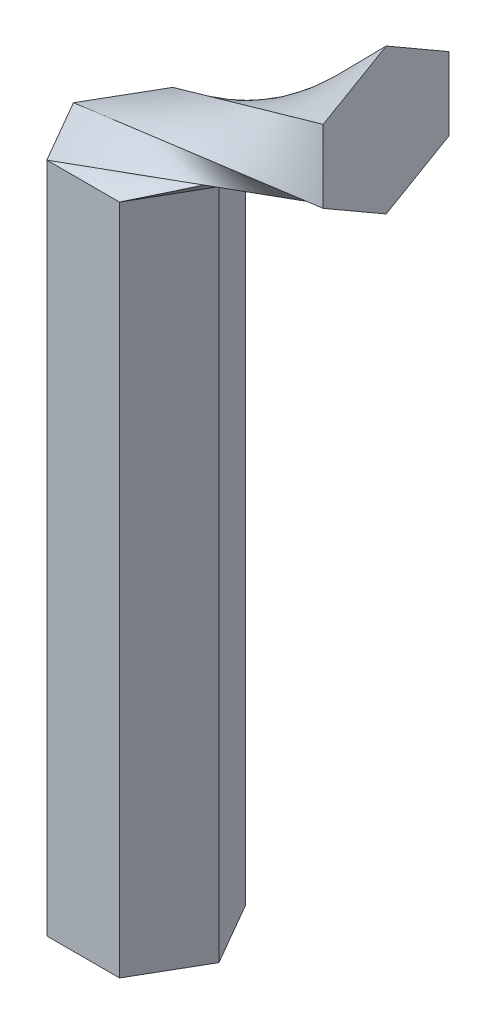
ISO-10303-21;
HEADER;
FILE_DESCRIPTION(('STEP AP214'),'2;1');
FILE_NAME('part.step','',(''),(''),'','','');
FILE_SCHEMA(('AUTOMOTIVE_DESIGN { 1 0 10303 214 1 1 1 1 }'));
ENDSEC;
DATA;
#1=APPLICATION_CONTEXT('core data for automotive mechanical design processes');
#2=APPLICATION_PROTOCOL_DEFINITION('international standard','automotive_design',2000,#1);
#3=PRODUCT_CONTEXT('',#1,'mechanical');
#4=PRODUCT('Part','Part','',(#3));
#5=PRODUCT_RELATED_PRODUCT_CATEGORY('part','',(#4));
#6=PRODUCT_DEFINITION_FORMATION('','',#4);
#7=PRODUCT_DEFINITION_CONTEXT('part definition',#1,'design');
#8=PRODUCT_DEFINITION('design','',#6,#7);
#9=PRODUCT_DEFINITION_SHAPE('','',#8);
#10=(LENGTH_UNIT() NAMED_UNIT(*) SI_UNIT(.MILLI.,.METRE.));
#11=(NAMED_UNIT(*) PLANE_ANGLE_UNIT() SI_UNIT($,.RADIAN.));
#12=(NAMED_UNIT(*) SI_UNIT($,.STERADIAN.) SOLID_ANGLE_UNIT());
#13=UNCERTAINTY_MEASURE_WITH_UNIT(LENGTH_MEASURE(1.E-05),#10,'distance_accuracy_value','');
#14=(GEOMETRIC_REPRESENTATION_CONTEXT(3) GLOBAL_UNCERTAINTY_ASSIGNED_CONTEXT((#13)) GLOBAL_UNIT_ASSIGNED_CONTEXT((#10,
#11,#12)) REPRESENTATION_CONTEXT('',''));
#15=CARTESIAN_POINT('',(0.,0.,0.));
#16=DIRECTION('',(0.,0.,1.));
#17=DIRECTION('',(1.,0.,0.));
#18=AXIS2_PLACEMENT_3D('',#15,#16,#17);
#19=CARTESIAN_POINT('',(3.84948291982184,35.56,6.66749999999999));
#20=DIRECTION('',(-0.866025403784439,0.,-0.5));
#21=DIRECTION('',(-0.5,0.,0.866025403784439));
#22=AXIS2_PLACEMENT_3D('',#19,#20,#21);
#23=PLANE('',#22);
#24=DIRECTION('',(0.5,0.,-0.866025403784439));
#25=VECTOR('',#24,1.);
#26=CARTESIAN_POINT('',(3.84948291982184,-35.56,6.66749999999999));
#27=LINE('',#26,#25);
#28=CARTESIAN_POINT('',(3.84948291982184,-35.56,6.66749999999999));
#29=VERTEX_POINT('',#28);
#30=CARTESIAN_POINT('',(7.69896583964366,-35.56,0.));
#31=VERTEX_POINT('',#30);
#32=EDGE_CURVE('E146',#29,#31,#27,.T.);
#33=ORIENTED_EDGE('',*,*,#32,.T.);
#34=DIRECTION('',(0.,-1.,0.));
#35=VECTOR('',#34,1.);
#36=CARTESIAN_POINT('',(7.69896583964366,35.56,0.));
#37=LINE('',#36,#35);
#38=CARTESIAN_POINT('',(7.69896583964366,35.56,0.));
#39=VERTEX_POINT('',#38);
#40=EDGE_CURVE('E12',#39,#31,#37,.T.);
#41=ORIENTED_EDGE('',*,*,#40,.F.);
#42=DIRECTION('',(-0.5,0.,0.866025403784439));
#43=VECTOR('',#42,1.);
#44=CARTESIAN_POINT('',(3.84948291982184,35.56,6.66749999999999));
#45=LINE('',#44,#43);
#46=CARTESIAN_POINT('',(3.84948291982183,35.56,6.6675));
#47=VERTEX_POINT('',#46);
#48=EDGE_CURVE('E60',#47,#39,#45,.F.);
#49=ORIENTED_EDGE('',*,*,#48,.F.);
#50=DIRECTION('',(0.,-1.,0.));
#51=VECTOR('',#50,1.);
#52=CARTESIAN_POINT('',(3.84948291982184,35.56,6.66749999999999));
#53=LINE('',#52,#51);
#54=EDGE_CURVE('E390',#47,#29,#53,.T.);
#55=ORIENTED_EDGE('',*,*,#54,.T.);
#56=EDGE_LOOP('',(#33,#41,#49,#55));
#57=FACE_BOUND('',#56,.T.);
#58=ADVANCED_FACE('F57',(#57),#23,.F.);
#59=CARTESIAN_POINT('',(7.69896583964366,35.56,0.));
#60=DIRECTION('',(-0.866025403784438,0.,0.5));
#61=DIRECTION('',(0.500000000000001,0.,0.866025403784438));
#62=AXIS2_PLACEMENT_3D('',#59,#60,#61);
#63=PLANE('',#62);
#64=DIRECTION('',(-0.500000000000001,0.,-0.866025403784438));
#65=VECTOR('',#64,1.);
#66=CARTESIAN_POINT('',(7.69896583964366,-35.56,0.));
#67=LINE('',#66,#65);
#68=CARTESIAN_POINT('',(3.84948291982181,-35.56,-6.6675));
#69=VERTEX_POINT('',#68);
#70=EDGE_CURVE('E415',#31,#69,#67,.T.);
#71=ORIENTED_EDGE('',*,*,#70,.T.);
#72=DIRECTION('',(0.,-1.,0.));
#73=VECTOR('',#72,1.);
#74=CARTESIAN_POINT('',(3.84948291982181,35.56,-6.6675));
#75=LINE('',#74,#73);
#76=CARTESIAN_POINT('',(3.84948291982181,35.56,-6.6675));
#77=VERTEX_POINT('',#76);
#78=EDGE_CURVE('E67',#77,#69,#75,.T.);
#79=ORIENTED_EDGE('',*,*,#78,.F.);
#80=DIRECTION('',(0.500000000000001,0.,0.866025403784438));
#81=VECTOR('',#80,1.);
#82=CARTESIAN_POINT('',(7.69896583964366,35.56,0.));
#83=LINE('',#82,#81);
#84=EDGE_CURVE('E134',#39,#77,#83,.F.);
#85=ORIENTED_EDGE('',*,*,#84,.F.);
#86=ORIENTED_EDGE('',*,*,#40,.T.);
#87=EDGE_LOOP('',(#71,#79,#85,#86));
#88=FACE_BOUND('',#87,.T.);
#89=ADVANCED_FACE('F135',(#88),#63,.F.);
#90=CARTESIAN_POINT('',(3.84948291982181,35.56,-6.6675));
#91=DIRECTION('',(0.,0.,1.));
#92=DIRECTION('',(1.,0.,0.));
#93=AXIS2_PLACEMENT_3D('',#90,#91,#92);
#94=PLANE('',#93);
#95=DIRECTION('',(-1.,0.,0.));
#96=VECTOR('',#95,1.);
#97=CARTESIAN_POINT('',(3.84948291982181,-35.56,-6.6675));
#98=LINE('',#97,#96);
#99=CARTESIAN_POINT('',(-3.84948291982183,-35.56,-6.6675));
#100=VERTEX_POINT('',#99);
#101=EDGE_CURVE('E412',#69,#100,#98,.T.);
#102=ORIENTED_EDGE('',*,*,#101,.T.);
#103=DIRECTION('',(0.,-1.,0.));
#104=VECTOR('',#103,1.);
#105=CARTESIAN_POINT('',(-3.84948291982183,35.56,-6.6675));
#106=LINE('',#105,#104);
#107=CARTESIAN_POINT('',(-3.84948291982183,35.56,-6.6675));
#108=VERTEX_POINT('',#107);
#109=EDGE_CURVE('E394',#108,#100,#106,.T.);
#110=ORIENTED_EDGE('',*,*,#109,.F.);
#111=DIRECTION('',(1.,0.,0.));
#112=VECTOR('',#111,1.);
#113=CARTESIAN_POINT('',(3.84948291982181,35.56,-6.6675));
#114=LINE('',#113,#112);
#115=EDGE_CURVE('E144',#77,#108,#114,.F.);
#116=ORIENTED_EDGE('',*,*,#115,.F.);
#117=ORIENTED_EDGE('',*,*,#78,.T.);
#118=EDGE_LOOP('',(#102,#110,#116,#117));
#119=FACE_BOUND('',#118,.T.);
#120=ADVANCED_FACE('F432',(#119),#94,.F.);
#121=CARTESIAN_POINT('',(-3.84948291982183,35.56,-6.6675));
#122=DIRECTION('',(0.866025403784438,0.,0.5));
#123=DIRECTION('',(0.5,0.,-0.866025403784438));
#124=AXIS2_PLACEMENT_3D('',#121,#122,#123);
#125=PLANE('',#124);
#126=DIRECTION('',(-0.5,0.,0.866025403784438));
#127=VECTOR('',#126,1.);
#128=CARTESIAN_POINT('',(-3.84948291982183,-35.56,-6.6675));
#129=LINE('',#128,#127);
#130=CARTESIAN_POINT('',(-7.69896583964366,-35.56,0.));
#131=VERTEX_POINT('',#130);
#132=EDGE_CURVE('E409',#100,#131,#129,.T.);
#133=ORIENTED_EDGE('',*,*,#132,.T.);
#134=DIRECTION('',(0.,-1.,0.));
#135=VECTOR('',#134,1.);
#136=CARTESIAN_POINT('',(-7.69896583964366,35.56,0.));
#137=LINE('',#136,#135);
#138=CARTESIAN_POINT('',(-7.69896583964366,35.56,0.));
#139=VERTEX_POINT('',#138);
#140=EDGE_CURVE('E398',#139,#131,#137,.T.);
#141=ORIENTED_EDGE('',*,*,#140,.F.);
#142=DIRECTION('',(0.5,0.,-0.866025403784438));
#143=VECTOR('',#142,1.);
#144=CARTESIAN_POINT('',(-3.84948291982183,35.56,-6.6675));
#145=LINE('',#144,#143);
#146=EDGE_CURVE('E314',#108,#139,#145,.F.);
#147=ORIENTED_EDGE('',*,*,#146,.F.);
#148=ORIENTED_EDGE('',*,*,#109,.T.);
#149=EDGE_LOOP('',(#133,#141,#147,#148));
#150=FACE_BOUND('',#149,.T.);
#151=ADVANCED_FACE('F433',(#150),#125,.F.);
#152=CARTESIAN_POINT('',(-7.69896583964366,35.56,0.));
#153=DIRECTION('',(0.866025403784438,0.,-0.500000000000001));
#154=DIRECTION('',(-0.500000000000001,0.,-0.866025403784438));
#155=AXIS2_PLACEMENT_3D('',#152,#153,#154);
#156=PLANE('',#155);
#157=DIRECTION('',(0.500000000000001,0.,0.866025403784438));
#158=VECTOR('',#157,1.);
#159=CARTESIAN_POINT('',(-7.69896583964366,-35.56,0.));
#160=LINE('',#159,#158);
#161=CARTESIAN_POINT('',(-3.84948291982183,-35.56,6.6675));
#162=VERTEX_POINT('',#161);
#163=EDGE_CURVE('E126',#131,#162,#160,.T.);
#164=ORIENTED_EDGE('',*,*,#163,.T.);
#165=DIRECTION('',(0.,-1.,0.));
#166=VECTOR('',#165,1.);
#167=CARTESIAN_POINT('',(-3.84948291982183,35.56,6.6675));
#168=LINE('',#167,#166);
#169=CARTESIAN_POINT('',(-3.84948291982184,35.56,6.6675));
#170=VERTEX_POINT('',#169);
#171=EDGE_CURVE('E76',#170,#162,#168,.T.);
#172=ORIENTED_EDGE('',*,*,#171,.F.);
#173=DIRECTION('',(-0.500000000000001,0.,-0.866025403784438));
#174=VECTOR('',#173,1.);
#175=CARTESIAN_POINT('',(-7.69896583964366,35.56,0.));
#176=LINE('',#175,#174);
#177=EDGE_CURVE('E382',#139,#170,#176,.F.);
#178=ORIENTED_EDGE('',*,*,#177,.F.);
#179=ORIENTED_EDGE('',*,*,#140,.T.);
#180=EDGE_LOOP('',(#164,#172,#178,#179));
#181=FACE_BOUND('',#180,.T.);
#182=ADVANCED_FACE('F427',(#181),#156,.F.);
#183=CARTESIAN_POINT('',(-3.84948291982183,35.56,6.6675));
#184=DIRECTION('',(0.,0.,-1.));
#185=DIRECTION('',(-1.,0.,0.));
#186=AXIS2_PLACEMENT_3D('',#183,#184,#185);
#187=PLANE('',#186);
#188=DIRECTION('',(1.,0.,0.));
#189=VECTOR('',#188,1.);
#190=CARTESIAN_POINT('',(-3.84948291982183,-35.56,6.6675));
#191=LINE('',#190,#189);
#192=EDGE_CURVE('E130',#162,#29,#191,.T.);
#193=ORIENTED_EDGE('',*,*,#192,.T.);
#194=ORIENTED_EDGE('',*,*,#54,.F.);
#195=DIRECTION('',(-1.,0.,0.));
#196=VECTOR('',#195,1.);
#197=CARTESIAN_POINT('',(-3.84948291982183,35.56,6.6675));
#198=LINE('',#197,#196);
#199=EDGE_CURVE('E387',#170,#47,#198,.F.);
#200=ORIENTED_EDGE('',*,*,#199,.F.);
#201=ORIENTED_EDGE('',*,*,#171,.T.);
#202=EDGE_LOOP('',(#193,#194,#200,#201));
#203=FACE_BOUND('',#202,.T.);
#204=ADVANCED_FACE('F440',(#203),#187,.F.);
#205=CARTESIAN_POINT('',(0.,-35.56,0.));
#206=DIRECTION('',(0.,1.,0.));
#207=DIRECTION('',(0.,0.,1.));
#208=AXIS2_PLACEMENT_3D('',#205,#206,#207);
#209=PLANE('',#208);
#210=ORIENTED_EDGE('',*,*,#32,.F.);
#211=ORIENTED_EDGE('',*,*,#192,.F.);
#212=ORIENTED_EDGE('',*,*,#163,.F.);
#213=ORIENTED_EDGE('',*,*,#132,.F.);
#214=ORIENTED_EDGE('',*,*,#101,.F.);
#215=ORIENTED_EDGE('',*,*,#70,.F.);
#216=EDGE_LOOP('',(#210,#211,#212,#213,#214,#215));
#217=FACE_BOUND('',#216,.T.);
#218=ADVANCED_FACE('F201',(#217),#209,.F.);
#219=CARTESIAN_POINT('',(25.4,0.,0.));
#220=DIRECTION('',(1.,0.,0.));
#221=DIRECTION('',(0.,0.,-1.));
#222=AXIS2_PLACEMENT_3D('',#219,#220,#221);
#223=PLANE('',#222);
#224=DIRECTION('',(0.,0.5,-0.866025403784439));
#225=VECTOR('',#224,1.);
#226=CARTESIAN_POINT('',(25.4,41.91,0.));
#227=LINE('',#226,#225);
#228=CARTESIAN_POINT('',(25.4,41.91,0.));
#229=VERTEX_POINT('',#228);
#230=CARTESIAN_POINT('',(25.4,45.7594829198218,-6.6675));
#231=VERTEX_POINT('',#230);
#232=EDGE_CURVE('E290',#229,#231,#227,.T.);
#233=ORIENTED_EDGE('',*,*,#232,.T.);
#234=DIRECTION('',(0.,1.,0.));
#235=VECTOR('',#234,1.);
#236=CARTESIAN_POINT('',(25.4,45.7594829198218,-6.6675));
#237=LINE('',#236,#235);
#238=CARTESIAN_POINT('',(25.4,53.4584487594655,-6.6675));
#239=VERTEX_POINT('',#238);
#240=EDGE_CURVE('E108',#231,#239,#237,.T.);
#241=ORIENTED_EDGE('',*,*,#240,.T.);
#242=DIRECTION('',(0.,0.5,0.866025403784439));
#243=VECTOR('',#242,1.);
#244=CARTESIAN_POINT('',(25.4,53.4584487594655,-6.6675));
#245=LINE('',#244,#243);
#246=CARTESIAN_POINT('',(25.4,57.3079316792873,0.));
#247=VERTEX_POINT('',#246);
#248=EDGE_CURVE('E153',#239,#247,#245,.T.);
#249=ORIENTED_EDGE('',*,*,#248,.T.);
#250=DIRECTION('',(0.,-0.499999999999999,0.866025403784439));
#251=VECTOR('',#250,1.);
#252=CARTESIAN_POINT('',(25.4,57.3079316792873,0.));
#253=LINE('',#252,#251);
#254=CARTESIAN_POINT('',(25.4,53.4584487594655,6.66749999999999));
#255=VERTEX_POINT('',#254);
#256=EDGE_CURVE('E295',#247,#255,#253,.T.);
#257=ORIENTED_EDGE('',*,*,#256,.T.);
#258=DIRECTION('',(0.,-1.,0.));
#259=VECTOR('',#258,1.);
#260=CARTESIAN_POINT('',(25.4,53.4584487594655,6.66749999999999));
#261=LINE('',#260,#259);
#262=CARTESIAN_POINT('',(25.4,45.7594829198218,6.66749999999999));
#263=VERTEX_POINT('',#262);
#264=EDGE_CURVE('E230',#255,#263,#261,.T.);
#265=ORIENTED_EDGE('',*,*,#264,.T.);
#266=DIRECTION('',(0.,-0.5,-0.866025403784439));
#267=VECTOR('',#266,1.);
#268=CARTESIAN_POINT('',(25.4,45.7594829198218,6.66749999999999));
#269=LINE('',#268,#267);
#270=EDGE_CURVE('E224',#263,#229,#269,.T.);
#271=ORIENTED_EDGE('',*,*,#270,.T.);
#272=EDGE_LOOP('',(#233,#241,#249,#257,#265,#271));
#273=FACE_BOUND('',#272,.T.);
#274=ADVANCED_FACE('F244',(#273),#223,.T.);
#275=CARTESIAN_POINT('',(25.4,45.7594829198218,6.66749999999999));
#276=CARTESIAN_POINT('',(-7.69896583964366,35.56,0.));
#277=CARTESIAN_POINT('',(25.4,47.0426438930958,6.66749999999999));
#278=CARTESIAN_POINT('',(-7.05738535300669,35.56,-1.11125));
#279=CARTESIAN_POINT('',(25.4,48.3258048663697,6.66749999999999));
#280=CARTESIAN_POINT('',(-6.41580486636972,35.56,-2.2225));
#281=CARTESIAN_POINT('',(25.4,50.8921268129176,6.66749999999999));
#282=CARTESIAN_POINT('',(-5.13264389309577,35.56,-4.445));
#283=CARTESIAN_POINT('',(25.4,52.1752877861916,6.66749999999999));
#284=CARTESIAN_POINT('',(-4.4910634064588,35.56,-5.55625));
#285=CARTESIAN_POINT('',(25.4,53.4584487594655,6.66749999999999));
#286=CARTESIAN_POINT('',(-3.84948291982183,35.56,-6.6675));
#287=B_SPLINE_SURFACE_WITH_KNOTS('',3,1,((#275,#276),(#277,#278),(#279,#280),(#281,#282),(#283,
#284),(#285,#286)),.UNSPECIFIED.,.F.,.F.,.F.,(4,2,4),(2,2),(0.,0.5,1.),(0.,1.),.UNSPECIFIED.);
#288=DIRECTION('',(-0.794978793454759,-0.486466281763534,-0.36243520064196));
#289=VECTOR('',#288,1.);
#290=CARTESIAN_POINT('',(10.7752585400891,44.5092243797327,0.));
#291=LINE('',#290,#289);
#292=EDGE_CURVE('E162',#255,#108,#291,.T.);
#293=DIRECTION('',(0.938425067978282,0.289176722280341,0.18903760229424));
#294=VECTOR('',#293,1.);
#295=CARTESIAN_POINT('',(8.85051708017817,40.6597414599109,3.33375));
#296=LINE('',#295,#294);
#297=EDGE_CURVE('E229',#139,#263,#296,.T.);
#298=ORIENTED_EDGE('',*,*,#264,.F.);
#299=ORIENTED_EDGE('',*,*,#292,.T.);
#300=ORIENTED_EDGE('',*,*,#146,.T.);
#301=ORIENTED_EDGE('',*,*,#297,.T.);
#302=EDGE_LOOP('',(#298,#299,#300,#301));
#303=FACE_BOUND('',#302,.T.);
#304=ADVANCED_FACE('F253',(#303),#287,.T.);
#305=CARTESIAN_POINT('',(25.4,53.4584487594655,6.66749999999999));
#306=CARTESIAN_POINT('',(-3.84948291982183,35.56,-6.6675));
#307=CARTESIAN_POINT('',(25.4,54.1000292461024,5.55625000000004));
#308=CARTESIAN_POINT('',(-2.56632194654789,35.56,-6.6675));
#309=CARTESIAN_POINT('',(25.4,54.7416097327394,4.44500000000006));
#310=CARTESIAN_POINT('',(-1.28316097327395,35.56,-6.6675));
#311=CARTESIAN_POINT('',(25.4,56.0247707060133,2.22250000000007));
#312=CARTESIAN_POINT('',(1.28316097327393,35.56,-6.6675));
#313=CARTESIAN_POINT('',(25.4,56.6663511926503,1.11125000000005));
#314=CARTESIAN_POINT('',(2.56632194654787,35.56,-6.6675));
#315=CARTESIAN_POINT('',(25.4,57.3079316792873,0.));
#316=CARTESIAN_POINT('',(3.84948291982181,35.56,-6.6675));
#317=B_SPLINE_SURFACE_WITH_KNOTS('',3,1,((#305,#306),(#307,#308),(#309,#310),(#311,#312),(#313,
#314),(#315,#316)),.UNSPECIFIED.,.F.,.F.,.F.,(4,2,4),(2,2),(0.,0.5,1.),(0.,1.),.UNSPECIFIED.);
#318=DIRECTION('',(-0.687756156910173,-0.694056381888354,-0.212784415294441));
#319=VECTOR('',#318,1.);
#320=CARTESIAN_POINT('',(14.6247414599109,46.4339658396437,-3.33375));
#321=LINE('',#320,#319);
#322=EDGE_CURVE('E156',#247,#77,#321,.T.);
#323=ORIENTED_EDGE('',*,*,#256,.F.);
#324=ORIENTED_EDGE('',*,*,#322,.T.);
#325=ORIENTED_EDGE('',*,*,#115,.T.);
#326=ORIENTED_EDGE('',*,*,#292,.F.);
#327=EDGE_LOOP('',(#323,#324,#325,#326));
#328=FACE_BOUND('',#327,.T.);
#329=ADVANCED_FACE('F337',(#328),#317,.T.);
#330=CARTESIAN_POINT('',(25.4,41.91,0.));
#331=CARTESIAN_POINT('',(-3.84948291982183,35.56,6.6675));
#332=CARTESIAN_POINT('',(25.4,42.551580486637,1.11124999999999));
#333=CARTESIAN_POINT('',(-4.4910634064588,35.56,5.55625));
#334=CARTESIAN_POINT('',(25.4,43.1931609732739,2.22249999999999));
#335=CARTESIAN_POINT('',(-5.13264389309577,35.56,4.445));
#336=CARTESIAN_POINT('',(25.4,44.4763219465479,4.44499999999999));
#337=CARTESIAN_POINT('',(-6.41580486636972,35.56,2.2225));
#338=CARTESIAN_POINT('',(25.4,45.1179024331848,5.55624999999999));
#339=CARTESIAN_POINT('',(-7.05738535300669,35.56,1.11125));
#340=CARTESIAN_POINT('',(25.4,45.7594829198218,6.66749999999999));
#341=CARTESIAN_POINT('',(-7.69896583964366,35.56,0.));
#342=B_SPLINE_SURFACE_WITH_KNOTS('',3,1,((#330,#331),(#332,#333),(#334,#335),(#336,#337),(#338,
#339),(#340,#341)),.UNSPECIFIED.,.F.,.F.,.F.,(4,2,4),(2,2),(0.,0.5,1.),(0.,1.),.UNSPECIFIED.);
#343=DIRECTION('',(-0.953855513921782,-0.207079985995192,0.217433985294952));
#344=VECTOR('',#343,1.);
#345=CARTESIAN_POINT('',(10.7752585400891,38.735,3.33375));
#346=LINE('',#345,#344);
#347=EDGE_CURVE('E160',#229,#170,#346,.T.);
#348=ORIENTED_EDGE('',*,*,#270,.F.);
#349=ORIENTED_EDGE('',*,*,#297,.F.);
#350=ORIENTED_EDGE('',*,*,#177,.T.);
#351=ORIENTED_EDGE('',*,*,#347,.F.);
#352=EDGE_LOOP('',(#348,#349,#350,#351));
#353=FACE_BOUND('',#352,.T.);
#354=ADVANCED_FACE('F321',(#353),#342,.T.);
#355=CARTESIAN_POINT('',(25.4,57.3079316792873,0.));
#356=CARTESIAN_POINT('',(3.84948291982181,35.56,-6.6675));
#357=CARTESIAN_POINT('',(25.4,56.6663511926503,-1.11125));
#358=CARTESIAN_POINT('',(4.49106340645879,35.56,-5.55625));
#359=CARTESIAN_POINT('',(25.4,56.0247707060134,-2.2225));
#360=CARTESIAN_POINT('',(5.13264389309576,35.56,-4.445));
#361=CARTESIAN_POINT('',(25.4,54.7416097327394,-4.445));
#362=CARTESIAN_POINT('',(6.41580486636971,35.56,-2.22249999999999));
#363=CARTESIAN_POINT('',(25.4,54.1000292461024,-5.55625));
#364=CARTESIAN_POINT('',(7.05738535300668,35.56,-1.11124999999999));
#365=CARTESIAN_POINT('',(25.4,53.4584487594655,-6.6675));
#366=CARTESIAN_POINT('',(7.69896583964366,35.56,0.));
#367=B_SPLINE_SURFACE_WITH_KNOTS('',3,1,((#355,#356),(#357,#358),(#359,#360),(#361,#362),(#363,
#364),(#365,#366)),.UNSPECIFIED.,.F.,.F.,.F.,(4,2,4),(2,2),(0.,0.5,1.),(0.,1.),.UNSPECIFIED.);
#368=DIRECTION('',(-0.679735632745105,-0.68731653091314,0.25603799700462));
#369=VECTOR('',#368,1.);
#370=CARTESIAN_POINT('',(16.5494829198218,44.5092243797327,-3.33374999999999));
#371=LINE('',#370,#369);
#372=EDGE_CURVE('E148',#239,#39,#371,.T.);
#373=ORIENTED_EDGE('',*,*,#248,.F.);
#374=ORIENTED_EDGE('',*,*,#372,.T.);
#375=ORIENTED_EDGE('',*,*,#84,.T.);
#376=ORIENTED_EDGE('',*,*,#322,.F.);
#377=EDGE_LOOP('',(#373,#374,#375,#376));
#378=FACE_BOUND('',#377,.T.);
#379=ADVANCED_FACE('F151',(#378),#367,.T.);
#380=CARTESIAN_POINT('',(25.4,53.4584487594655,-6.6675));
#381=CARTESIAN_POINT('',(7.69896583964365,35.56,0.));
#382=CARTESIAN_POINT('',(25.4,52.1752877861915,-6.6675));
#383=CARTESIAN_POINT('',(7.05738535300669,35.56,1.11125));
#384=CARTESIAN_POINT('',(25.4,50.8921268129176,-6.6675));
#385=CARTESIAN_POINT('',(6.41580486636972,35.56,2.22249999999999));
#386=CARTESIAN_POINT('',(25.4,48.3258048663697,-6.6675));
#387=CARTESIAN_POINT('',(5.13264389309578,35.56,4.44499999999999));
#388=CARTESIAN_POINT('',(25.4,47.0426438930958,-6.6675));
#389=CARTESIAN_POINT('',(4.49106340645881,35.56,5.55624999999999));
#390=CARTESIAN_POINT('',(25.4,45.7594829198218,-6.6675));
#391=CARTESIAN_POINT('',(3.84948291982184,35.56,6.66749999999999));
#392=B_SPLINE_SURFACE_WITH_KNOTS('',3,1,((#380,#381),(#382,#383),(#384,#385),(#386,#387),(#388,
#389),(#390,#391)),.UNSPECIFIED.,.F.,.F.,.F.,(4,2,4),(2,2),(0.,0.5,1.),(0.,1.),.UNSPECIFIED.);
#393=DIRECTION('',(-0.788874327023994,-0.373360425387095,0.488138596012657));
#394=VECTOR('',#393,1.);
#395=CARTESIAN_POINT('',(14.6247414599109,40.6597414599109,0.));
#396=LINE('',#395,#394);
#397=EDGE_CURVE('E149',#231,#47,#396,.T.);
#398=ORIENTED_EDGE('',*,*,#240,.F.);
#399=ORIENTED_EDGE('',*,*,#397,.T.);
#400=ORIENTED_EDGE('',*,*,#48,.T.);
#401=ORIENTED_EDGE('',*,*,#372,.F.);
#402=EDGE_LOOP('',(#398,#399,#400,#401));
#403=FACE_BOUND('',#402,.T.);
#404=ADVANCED_FACE('F147',(#403),#392,.T.);
#405=CARTESIAN_POINT('',(25.4,45.7594829198218,-6.6675));
#406=CARTESIAN_POINT('',(3.84948291982184,35.56,6.66749999999999));
#407=CARTESIAN_POINT('',(25.4,45.1179024331848,-5.55624999999999));
#408=CARTESIAN_POINT('',(2.56632194654786,35.56,6.66749999999999));
#409=CARTESIAN_POINT('',(25.4,44.4763219465479,-4.44499999999999));
#410=CARTESIAN_POINT('',(1.28316097327391,35.56,6.66749999999999));
#411=CARTESIAN_POINT('',(25.4,43.1931609732739,-2.22249999999999));
#412=CARTESIAN_POINT('',(-1.28316097327398,35.56,6.6675));
#413=CARTESIAN_POINT('',(25.4,42.551580486637,-1.11124999999999));
#414=CARTESIAN_POINT('',(-2.56632194654791,35.56,6.6675));
#415=CARTESIAN_POINT('',(25.4,41.91,0.));
#416=CARTESIAN_POINT('',(-3.84948291982183,35.56,6.6675));
#417=B_SPLINE_SURFACE_WITH_KNOTS('',3,1,((#405,#406),(#407,#408),(#409,#410),(#411,#412),(#413,
#414),(#415,#416)),.UNSPECIFIED.,.F.,.F.,.F.,(4,2,4),(2,2),(0.,0.5,1.),(0.,1.),.UNSPECIFIED.);
#418=ORIENTED_EDGE('',*,*,#232,.F.);
#419=ORIENTED_EDGE('',*,*,#347,.T.);
#420=ORIENTED_EDGE('',*,*,#199,.T.);
#421=ORIENTED_EDGE('',*,*,#397,.F.);
#422=EDGE_LOOP('',(#418,#419,#420,#421));
#423=FACE_BOUND('',#422,.T.);
#424=ADVANCED_FACE('F185',(#423),#417,.T.);
#425=CLOSED_SHELL('',(#58,#89,#120,#151,#182,#204,#218,#274,#304,#329,#354,#379,#404,#424));
#426=MANIFOLD_SOLID_BREP('B2',#425);
#427=ADVANCED_BREP_SHAPE_REPRESENTATION('',(#18,#426),#14);
#428=SHAPE_DEFINITION_REPRESENTATION(#9,#427);
ENDSEC;
END-ISO-10303-21;
